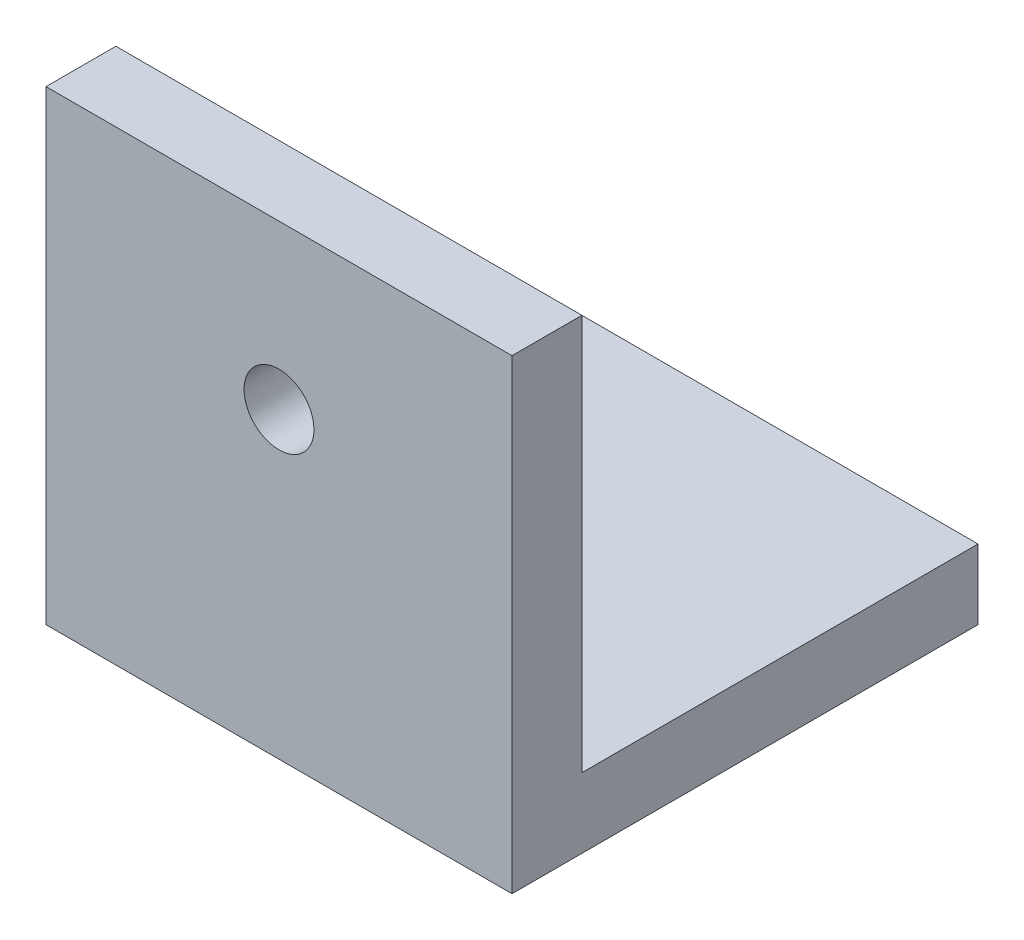
ISO-10303-21;
HEADER;
FILE_DESCRIPTION(('STEP AP214'),'2;1');
FILE_NAME('part.step','',(''),(''),'','','');
FILE_SCHEMA(('AUTOMOTIVE_DESIGN { 1 0 10303 214 1 1 1 1 }'));
ENDSEC;
DATA;
#1=APPLICATION_CONTEXT('core data for automotive mechanical design processes');
#2=APPLICATION_PROTOCOL_DEFINITION('international standard','automotive_design',2000,#1);
#3=PRODUCT_CONTEXT('',#1,'mechanical');
#4=PRODUCT('Part','Part','',(#3));
#5=PRODUCT_RELATED_PRODUCT_CATEGORY('part','',(#4));
#6=PRODUCT_DEFINITION_FORMATION('','',#4);
#7=PRODUCT_DEFINITION_CONTEXT('part definition',#1,'design');
#8=PRODUCT_DEFINITION('design','',#6,#7);
#9=PRODUCT_DEFINITION_SHAPE('','',#8);
#10=(LENGTH_UNIT() NAMED_UNIT(*) SI_UNIT(.MILLI.,.METRE.));
#11=(NAMED_UNIT(*) PLANE_ANGLE_UNIT() SI_UNIT($,.RADIAN.));
#12=(NAMED_UNIT(*) SI_UNIT($,.STERADIAN.) SOLID_ANGLE_UNIT());
#13=UNCERTAINTY_MEASURE_WITH_UNIT(LENGTH_MEASURE(1.E-05),#10,'distance_accuracy_value','');
#14=(GEOMETRIC_REPRESENTATION_CONTEXT(3) GLOBAL_UNCERTAINTY_ASSIGNED_CONTEXT((#13)) GLOBAL_UNIT_ASSIGNED_CONTEXT((#10,
#11,#12)) REPRESENTATION_CONTEXT('',''));
#15=CARTESIAN_POINT('',(0.,0.,0.));
#16=DIRECTION('',(0.,0.,1.));
#17=DIRECTION('',(1.,0.,0.));
#18=AXIS2_PLACEMENT_3D('',#15,#16,#17);
#19=CARTESIAN_POINT('',(0.,0.,15.));
#20=DIRECTION('',(0.,0.,-1.));
#21=DIRECTION('',(-1.,0.,0.));
#22=AXIS2_PLACEMENT_3D('',#19,#20,#21);
#23=PLANE('',#22);
#24=DIRECTION('',(0.,1.,0.));
#25=VECTOR('',#24,1.);
#26=CARTESIAN_POINT('',(50.,50.,15.));
#27=LINE('',#26,#25);
#28=CARTESIAN_POINT('',(50.,-50.,15.));
#29=VERTEX_POINT('',#28);
#30=CARTESIAN_POINT('',(50.,50.,15.));
#31=VERTEX_POINT('',#30);
#32=EDGE_CURVE('E132',#29,#31,#27,.T.);
#33=ORIENTED_EDGE('',*,*,#32,.T.);
#34=DIRECTION('',(-1.,0.,0.));
#35=VECTOR('',#34,1.);
#36=CARTESIAN_POINT('',(50.,50.,15.));
#37=LINE('',#36,#35);
#38=CARTESIAN_POINT('',(-50.,50.,15.));
#39=VERTEX_POINT('',#38);
#40=EDGE_CURVE('E77',#31,#39,#37,.T.);
#41=ORIENTED_EDGE('',*,*,#40,.T.);
#42=DIRECTION('',(0.,-1.,0.));
#43=VECTOR('',#42,1.);
#44=CARTESIAN_POINT('',(-50.,50.,15.));
#45=LINE('',#44,#43);
#46=CARTESIAN_POINT('',(-50.,-50.,15.));
#47=VERTEX_POINT('',#46);
#48=EDGE_CURVE('E136',#39,#47,#45,.T.);
#49=ORIENTED_EDGE('',*,*,#48,.T.);
#50=DIRECTION('',(1.,0.,0.));
#51=VECTOR('',#50,1.);
#52=CARTESIAN_POINT('',(50.,-50.,15.));
#53=LINE('',#52,#51);
#54=EDGE_CURVE('E57',#47,#29,#53,.T.);
#55=ORIENTED_EDGE('',*,*,#54,.T.);
#56=EDGE_LOOP('',(#33,#41,#49,#55));
#57=FACE_BOUND('',#56,.T.);
#58=CARTESIAN_POINT('',(0.,15.,15.));
#59=DIRECTION('',(0.,0.,1.));
#60=DIRECTION('',(1.,0.,0.));
#61=AXIS2_PLACEMENT_3D('',#58,#59,#60);
#62=CIRCLE('',#61,7.5);
#63=CARTESIAN_POINT('',(7.50000000000001,15.,15.));
#64=VERTEX_POINT('',#63);
#65=EDGE_CURVE('E126',#64,#64,#62,.T.);
#66=ORIENTED_EDGE('',*,*,#65,.F.);
#67=EDGE_LOOP('',(#66));
#68=FACE_BOUND('',#67,.T.);
#69=ADVANCED_FACE('F33',(#57,#68),#23,.F.);
#70=CARTESIAN_POINT('',(0.,0.,0.));
#71=DIRECTION('',(0.,0.,-1.));
#72=DIRECTION('',(-1.,0.,0.));
#73=AXIS2_PLACEMENT_3D('',#70,#71,#72);
#74=PLANE('',#73);
#75=DIRECTION('',(1.,0.,0.));
#76=VECTOR('',#75,1.);
#77=CARTESIAN_POINT('',(-50.,-35.,0.));
#78=LINE('',#77,#76);
#79=CARTESIAN_POINT('',(-50.,-35.,0.));
#80=VERTEX_POINT('',#79);
#81=CARTESIAN_POINT('',(50.,-35.,0.));
#82=VERTEX_POINT('',#81);
#83=EDGE_CURVE('E48',#80,#82,#78,.T.);
#84=ORIENTED_EDGE('',*,*,#83,.F.);
#85=DIRECTION('',(0.,-1.,0.));
#86=VECTOR('',#85,1.);
#87=CARTESIAN_POINT('',(-50.,50.,0.));
#88=LINE('',#87,#86);
#89=CARTESIAN_POINT('',(-50.,50.,0.));
#90=VERTEX_POINT('',#89);
#91=EDGE_CURVE('E134',#90,#80,#88,.T.);
#92=ORIENTED_EDGE('',*,*,#91,.F.);
#93=DIRECTION('',(-1.,0.,0.));
#94=VECTOR('',#93,1.);
#95=CARTESIAN_POINT('',(50.,50.,0.));
#96=LINE('',#95,#94);
#97=CARTESIAN_POINT('',(50.,50.,0.));
#98=VERTEX_POINT('',#97);
#99=EDGE_CURVE('E72',#98,#90,#96,.T.);
#100=ORIENTED_EDGE('',*,*,#99,.F.);
#101=DIRECTION('',(0.,1.,0.));
#102=VECTOR('',#101,1.);
#103=CARTESIAN_POINT('',(50.,50.,0.));
#104=LINE('',#103,#102);
#105=EDGE_CURVE('E129',#82,#98,#104,.T.);
#106=ORIENTED_EDGE('',*,*,#105,.F.);
#107=EDGE_LOOP('',(#84,#92,#100,#106));
#108=FACE_BOUND('',#107,.T.);
#109=CARTESIAN_POINT('',(0.,15.,0.));
#110=DIRECTION('',(0.,0.,1.));
#111=DIRECTION('',(1.,0.,0.));
#112=AXIS2_PLACEMENT_3D('',#109,#110,#111);
#113=CIRCLE('',#112,7.5);
#114=CARTESIAN_POINT('',(7.50000000000001,15.,0.));
#115=VERTEX_POINT('',#114);
#116=EDGE_CURVE('E124',#115,#115,#113,.T.);
#117=ORIENTED_EDGE('',*,*,#116,.T.);
#118=EDGE_LOOP('',(#117));
#119=FACE_BOUND('',#118,.T.);
#120=ADVANCED_FACE('F142',(#108,#119),#74,.T.);
#121=CARTESIAN_POINT('',(50.,50.,15.));
#122=DIRECTION('',(-1.,0.,0.));
#123=DIRECTION('',(0.,-1.,0.));
#124=AXIS2_PLACEMENT_3D('',#121,#122,#123);
#125=PLANE('',#124);
#126=DIRECTION('',(0.,0.,-1.));
#127=VECTOR('',#126,1.);
#128=CARTESIAN_POINT('',(50.,-50.,15.));
#129=LINE('',#128,#127);
#130=CARTESIAN_POINT('',(50.,-50.,-85.));
#131=VERTEX_POINT('',#130);
#132=EDGE_CURVE('E102',#29,#131,#129,.T.);
#133=ORIENTED_EDGE('',*,*,#132,.T.);
#134=DIRECTION('',(0.,1.,0.));
#135=VECTOR('',#134,1.);
#136=CARTESIAN_POINT('',(50.,-35.,-85.));
#137=LINE('',#136,#135);
#138=CARTESIAN_POINT('',(50.,-35.,-85.));
#139=VERTEX_POINT('',#138);
#140=EDGE_CURVE('E110',#131,#139,#137,.T.);
#141=ORIENTED_EDGE('',*,*,#140,.T.);
#142=DIRECTION('',(0.,0.,1.));
#143=VECTOR('',#142,1.);
#144=CARTESIAN_POINT('',(50.,-35.,0.));
#145=LINE('',#144,#143);
#146=EDGE_CURVE('E116',#139,#82,#145,.T.);
#147=ORIENTED_EDGE('',*,*,#146,.T.);
#148=ORIENTED_EDGE('',*,*,#105,.T.);
#149=DIRECTION('',(0.,0.,-1.));
#150=VECTOR('',#149,1.);
#151=CARTESIAN_POINT('',(50.,50.,15.));
#152=LINE('',#151,#150);
#153=EDGE_CURVE('E11',#31,#98,#152,.T.);
#154=ORIENTED_EDGE('',*,*,#153,.F.);
#155=ORIENTED_EDGE('',*,*,#32,.F.);
#156=EDGE_LOOP('',(#133,#141,#147,#148,#154,#155));
#157=FACE_BOUND('',#156,.T.);
#158=ADVANCED_FACE('F35',(#157),#125,.F.);
#159=CARTESIAN_POINT('',(50.,50.,15.));
#160=DIRECTION('',(0.,-1.,0.));
#161=DIRECTION('',(1.,0.,0.));
#162=AXIS2_PLACEMENT_3D('',#159,#160,#161);
#163=PLANE('',#162);
#164=ORIENTED_EDGE('',*,*,#99,.T.);
#165=DIRECTION('',(0.,0.,-1.));
#166=VECTOR('',#165,1.);
#167=CARTESIAN_POINT('',(-50.,50.,15.));
#168=LINE('',#167,#166);
#169=EDGE_CURVE('E41',#39,#90,#168,.T.);
#170=ORIENTED_EDGE('',*,*,#169,.F.);
#171=ORIENTED_EDGE('',*,*,#40,.F.);
#172=ORIENTED_EDGE('',*,*,#153,.T.);
#173=EDGE_LOOP('',(#164,#170,#171,#172));
#174=FACE_BOUND('',#173,.T.);
#175=ADVANCED_FACE('F145',(#174),#163,.F.);
#176=CARTESIAN_POINT('',(-50.,50.,15.));
#177=DIRECTION('',(1.,0.,0.));
#178=DIRECTION('',(0.,1.,0.));
#179=AXIS2_PLACEMENT_3D('',#176,#177,#178);
#180=PLANE('',#179);
#181=ORIENTED_EDGE('',*,*,#91,.T.);
#182=DIRECTION('',(0.,0.,1.));
#183=VECTOR('',#182,1.);
#184=CARTESIAN_POINT('',(-50.,-35.,0.));
#185=LINE('',#184,#183);
#186=CARTESIAN_POINT('',(-50.,-35.,-85.));
#187=VERTEX_POINT('',#186);
#188=EDGE_CURVE('E112',#187,#80,#185,.T.);
#189=ORIENTED_EDGE('',*,*,#188,.F.);
#190=DIRECTION('',(0.,1.,0.));
#191=VECTOR('',#190,1.);
#192=CARTESIAN_POINT('',(-50.,-35.,-85.));
#193=LINE('',#192,#191);
#194=CARTESIAN_POINT('',(-50.,-50.,-85.));
#195=VERTEX_POINT('',#194);
#196=EDGE_CURVE('E107',#195,#187,#193,.T.);
#197=ORIENTED_EDGE('',*,*,#196,.F.);
#198=DIRECTION('',(0.,0.,-1.));
#199=VECTOR('',#198,1.);
#200=CARTESIAN_POINT('',(-50.,-50.,15.));
#201=LINE('',#200,#199);
#202=EDGE_CURVE('E94',#47,#195,#201,.T.);
#203=ORIENTED_EDGE('',*,*,#202,.F.);
#204=ORIENTED_EDGE('',*,*,#48,.F.);
#205=ORIENTED_EDGE('',*,*,#169,.T.);
#206=EDGE_LOOP('',(#181,#189,#197,#203,#204,#205));
#207=FACE_BOUND('',#206,.T.);
#208=ADVANCED_FACE('F114',(#207),#180,.F.);
#209=CARTESIAN_POINT('',(50.,-50.,15.));
#210=DIRECTION('',(0.,1.,0.));
#211=DIRECTION('',(-1.,0.,0.));
#212=AXIS2_PLACEMENT_3D('',#209,#210,#211);
#213=PLANE('',#212);
#214=ORIENTED_EDGE('',*,*,#202,.T.);
#215=DIRECTION('',(1.,0.,0.));
#216=VECTOR('',#215,1.);
#217=CARTESIAN_POINT('',(-50.,-50.,-85.));
#218=LINE('',#217,#216);
#219=EDGE_CURVE('E97',#195,#131,#218,.T.);
#220=ORIENTED_EDGE('',*,*,#219,.T.);
#221=ORIENTED_EDGE('',*,*,#132,.F.);
#222=ORIENTED_EDGE('',*,*,#54,.F.);
#223=EDGE_LOOP('',(#214,#220,#221,#222));
#224=FACE_BOUND('',#223,.T.);
#225=ADVANCED_FACE('F96',(#224),#213,.F.);
#226=CARTESIAN_POINT('',(0.,15.,15.));
#227=DIRECTION('',(0.,0.,-1.));
#228=DIRECTION('',(-1.,0.,0.));
#229=AXIS2_PLACEMENT_3D('',#226,#227,#228);
#230=CYLINDRICAL_SURFACE('',#229,7.5);
#231=ORIENTED_EDGE('',*,*,#65,.T.);
#232=EDGE_LOOP('',(#231));
#233=FACE_BOUND('',#232,.T.);
#234=ORIENTED_EDGE('',*,*,#116,.F.);
#235=EDGE_LOOP('',(#234));
#236=FACE_BOUND('',#235,.T.);
#237=ADVANCED_FACE('F152',(#233,#236),#230,.F.);
#238=CARTESIAN_POINT('',(-50.,-35.,0.));
#239=DIRECTION('',(0.,1.,0.));
#240=DIRECTION('',(-1.,0.,0.));
#241=AXIS2_PLACEMENT_3D('',#238,#239,#240);
#242=PLANE('',#241);
#243=ORIENTED_EDGE('',*,*,#146,.F.);
#244=DIRECTION('',(1.,0.,0.));
#245=VECTOR('',#244,1.);
#246=CARTESIAN_POINT('',(-50.,-35.,-85.));
#247=LINE('',#246,#245);
#248=EDGE_CURVE('E111',#187,#139,#247,.T.);
#249=ORIENTED_EDGE('',*,*,#248,.F.);
#250=ORIENTED_EDGE('',*,*,#188,.T.);
#251=ORIENTED_EDGE('',*,*,#83,.T.);
#252=EDGE_LOOP('',(#243,#249,#250,#251));
#253=FACE_BOUND('',#252,.T.);
#254=ADVANCED_FACE('F150',(#253),#242,.T.);
#255=CARTESIAN_POINT('',(-50.,-35.,-85.));
#256=DIRECTION('',(0.,0.,-1.));
#257=DIRECTION('',(-1.,0.,0.));
#258=AXIS2_PLACEMENT_3D('',#255,#256,#257);
#259=PLANE('',#258);
#260=ORIENTED_EDGE('',*,*,#140,.F.);
#261=ORIENTED_EDGE('',*,*,#219,.F.);
#262=ORIENTED_EDGE('',*,*,#196,.T.);
#263=ORIENTED_EDGE('',*,*,#248,.T.);
#264=EDGE_LOOP('',(#260,#261,#262,#263));
#265=FACE_BOUND('',#264,.T.);
#266=ADVANCED_FACE('F106',(#265),#259,.T.);
#267=CLOSED_SHELL('',(#69,#120,#158,#175,#208,#225,#237,#254,#266));
#268=MANIFOLD_SOLID_BREP('B2',#267);
#269=ADVANCED_BREP_SHAPE_REPRESENTATION('',(#18,#268),#14);
#270=SHAPE_DEFINITION_REPRESENTATION(#9,#269);
ENDSEC;
END-ISO-10303-21;
